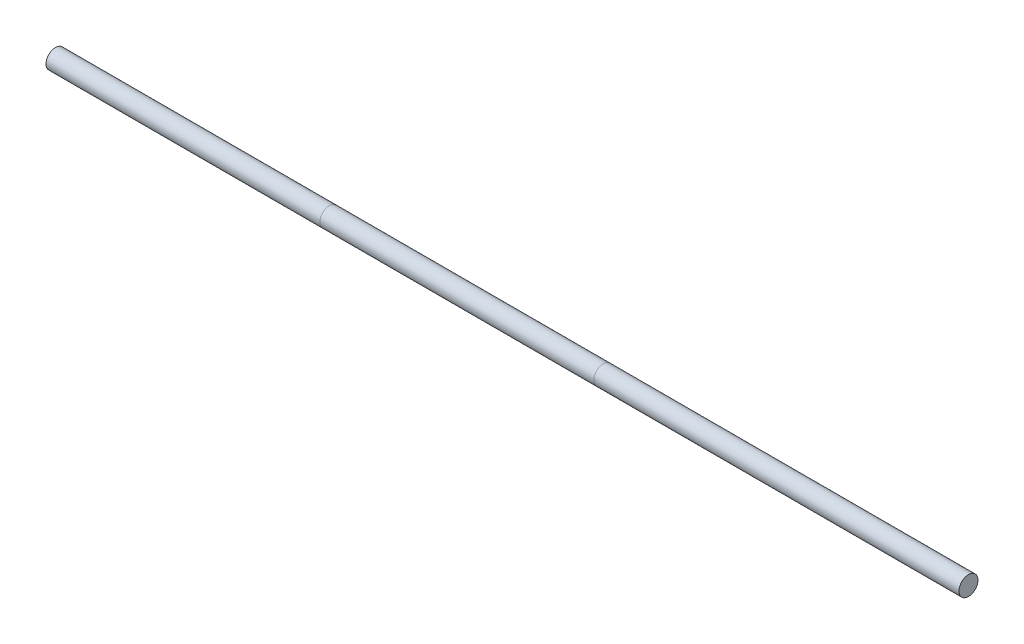
ISO-10303-21;
HEADER;
FILE_DESCRIPTION(('STEP AP214'),'2;1');
FILE_NAME('part.step','',(''),(''),'','','');
FILE_SCHEMA(('AUTOMOTIVE_DESIGN { 1 0 10303 214 1 1 1 1 }'));
ENDSEC;
DATA;
#1=APPLICATION_CONTEXT('core data for automotive mechanical design processes');
#2=APPLICATION_PROTOCOL_DEFINITION('international standard','automotive_design',2000,#1);
#3=PRODUCT_CONTEXT('',#1,'mechanical');
#4=PRODUCT('Part','Part','',(#3));
#5=PRODUCT_RELATED_PRODUCT_CATEGORY('part','',(#4));
#6=PRODUCT_DEFINITION_FORMATION('','',#4);
#7=PRODUCT_DEFINITION_CONTEXT('part definition',#1,'design');
#8=PRODUCT_DEFINITION('design','',#6,#7);
#9=PRODUCT_DEFINITION_SHAPE('','',#8);
#10=(LENGTH_UNIT() NAMED_UNIT(*) SI_UNIT(.MILLI.,.METRE.));
#11=(NAMED_UNIT(*) PLANE_ANGLE_UNIT() SI_UNIT($,.RADIAN.));
#12=(NAMED_UNIT(*) SI_UNIT($,.STERADIAN.) SOLID_ANGLE_UNIT());
#13=UNCERTAINTY_MEASURE_WITH_UNIT(LENGTH_MEASURE(1.E-05),#10,'distance_accuracy_value','');
#14=(GEOMETRIC_REPRESENTATION_CONTEXT(3) GLOBAL_UNCERTAINTY_ASSIGNED_CONTEXT((#13)) GLOBAL_UNIT_ASSIGNED_CONTEXT((#10,
#11,#12)) REPRESENTATION_CONTEXT('',''));
#15=CARTESIAN_POINT('',(0.,0.,0.));
#16=DIRECTION('',(0.,0.,1.));
#17=DIRECTION('',(1.,0.,0.));
#18=AXIS2_PLACEMENT_3D('',#15,#16,#17);
#19=CARTESIAN_POINT('',(3048.,0.,0.));
#20=DIRECTION('',(-1.,0.,0.));
#21=DIRECTION('',(0.,0.,1.));
#22=AXIS2_PLACEMENT_3D('',#19,#20,#21);
#23=CYLINDRICAL_SURFACE('',#22,31.75);
#24=CARTESIAN_POINT('',(3048.,0.,0.));
#25=DIRECTION('',(1.,0.,0.));
#26=DIRECTION('',(0.,0.,-1.));
#27=AXIS2_PLACEMENT_3D('',#24,#25,#26);
#28=CIRCLE('',#27,31.75);
#29=CARTESIAN_POINT('',(3048.,0.,-31.75));
#30=VERTEX_POINT('',#29);
#31=EDGE_CURVE('E11',#30,#30,#28,.T.);
#32=ORIENTED_EDGE('',*,*,#31,.F.);
#33=EDGE_LOOP('',(#32));
#34=FACE_BOUND('',#33,.T.);
#35=CARTESIAN_POINT('',(1828.8,0.,0.));
#36=DIRECTION('',(1.,0.,0.));
#37=DIRECTION('',(0.,0.,-1.));
#38=AXIS2_PLACEMENT_3D('',#35,#36,#37);
#39=CIRCLE('',#38,31.75);
#40=CARTESIAN_POINT('',(1828.8,0.,-31.75));
#41=VERTEX_POINT('',#40);
#42=EDGE_CURVE('E49',#41,#41,#39,.T.);
#43=ORIENTED_EDGE('',*,*,#42,.T.);
#44=EDGE_LOOP('',(#43));
#45=FACE_BOUND('',#44,.T.);
#46=ADVANCED_FACE('F46',(#34,#45),#23,.T.);
#47=CARTESIAN_POINT('',(3048.,0.,0.));
#48=DIRECTION('',(1.,0.,0.));
#49=DIRECTION('',(0.,0.,-1.));
#50=AXIS2_PLACEMENT_3D('',#47,#48,#49);
#51=PLANE('',#50);
#52=ORIENTED_EDGE('',*,*,#31,.T.);
#53=EDGE_LOOP('',(#52));
#54=FACE_BOUND('',#53,.T.);
#55=ADVANCED_FACE('F61',(#54),#51,.T.);
#56=CARTESIAN_POINT('',(1828.8,0.,0.));
#57=DIRECTION('',(1.,0.,0.));
#58=DIRECTION('',(0.,0.,-1.));
#59=AXIS2_PLACEMENT_3D('',#56,#57,#58);
#60=PLANE('',#59);
#61=ORIENTED_EDGE('',*,*,#42,.F.);
#62=EDGE_LOOP('',(#61));
#63=FACE_BOUND('',#62,.T.);
#64=ADVANCED_FACE('F59',(#63),#60,.F.);
#65=CLOSED_SHELL('',(#46,#55,#64));
#66=MANIFOLD_SOLID_BREP('B2',#65);
#67=CARTESIAN_POINT('',(1828.8,0.,0.));
#68=DIRECTION('',(-1.,0.,0.));
#69=DIRECTION('',(0.,0.,1.));
#70=AXIS2_PLACEMENT_3D('',#67,#68,#69);
#71=CYLINDRICAL_SURFACE('',#70,31.75);
#72=CARTESIAN_POINT('',(1828.8,0.,0.));
#73=DIRECTION('',(1.,0.,0.));
#74=DIRECTION('',(0.,0.,-1.));
#75=AXIS2_PLACEMENT_3D('',#72,#73,#74);
#76=CIRCLE('',#75,31.75);
#77=CARTESIAN_POINT('',(1828.8,0.,-31.75));
#78=VERTEX_POINT('',#77);
#79=EDGE_CURVE('E45',#78,#78,#76,.T.);
#80=ORIENTED_EDGE('',*,*,#79,.F.);
#81=EDGE_LOOP('',(#80));
#82=FACE_BOUND('',#81,.T.);
#83=CARTESIAN_POINT('',(914.4,0.,0.));
#84=DIRECTION('',(1.,0.,0.));
#85=DIRECTION('',(0.,0.,-1.));
#86=AXIS2_PLACEMENT_3D('',#83,#84,#85);
#87=CIRCLE('',#86,31.75);
#88=CARTESIAN_POINT('',(914.4,0.,-31.75));
#89=VERTEX_POINT('',#88);
#90=EDGE_CURVE('E97',#89,#89,#87,.T.);
#91=ORIENTED_EDGE('',*,*,#90,.T.);
#92=EDGE_LOOP('',(#91));
#93=FACE_BOUND('',#92,.T.);
#94=ADVANCED_FACE('F94',(#82,#93),#71,.T.);
#95=CARTESIAN_POINT('',(1828.8,0.,0.));
#96=DIRECTION('',(1.,0.,0.));
#97=DIRECTION('',(0.,0.,-1.));
#98=AXIS2_PLACEMENT_3D('',#95,#96,#97);
#99=PLANE('',#98);
#100=ORIENTED_EDGE('',*,*,#79,.T.);
#101=EDGE_LOOP('',(#100));
#102=FACE_BOUND('',#101,.T.);
#103=ADVANCED_FACE('F109',(#102),#99,.T.);
#104=CARTESIAN_POINT('',(914.4,0.,0.));
#105=DIRECTION('',(1.,0.,0.));
#106=DIRECTION('',(0.,0.,-1.));
#107=AXIS2_PLACEMENT_3D('',#104,#105,#106);
#108=PLANE('',#107);
#109=ORIENTED_EDGE('',*,*,#90,.F.);
#110=EDGE_LOOP('',(#109));
#111=FACE_BOUND('',#110,.T.);
#112=ADVANCED_FACE('F107',(#111),#108,.F.);
#113=CLOSED_SHELL('',(#94,#103,#112));
#114=MANIFOLD_SOLID_BREP('B6',#113);
#115=CARTESIAN_POINT('',(914.4,0.,0.));
#116=DIRECTION('',(-1.,0.,0.));
#117=DIRECTION('',(0.,0.,1.));
#118=AXIS2_PLACEMENT_3D('',#115,#116,#117);
#119=CYLINDRICAL_SURFACE('',#118,31.75);
#120=CARTESIAN_POINT('',(914.4,0.,0.));
#121=DIRECTION('',(1.,0.,0.));
#122=DIRECTION('',(0.,0.,-1.));
#123=AXIS2_PLACEMENT_3D('',#120,#121,#122);
#124=CIRCLE('',#123,31.75);
#125=CARTESIAN_POINT('',(914.4,0.,-31.75));
#126=VERTEX_POINT('',#125);
#127=EDGE_CURVE('E93',#126,#126,#124,.T.);
#128=ORIENTED_EDGE('',*,*,#127,.F.);
#129=EDGE_LOOP('',(#128));
#130=FACE_BOUND('',#129,.T.);
#131=CARTESIAN_POINT('',(0.,0.,0.));
#132=DIRECTION('',(1.,0.,0.));
#133=DIRECTION('',(0.,0.,-1.));
#134=AXIS2_PLACEMENT_3D('',#131,#132,#133);
#135=CIRCLE('',#134,31.75);
#136=CARTESIAN_POINT('',(0.,0.,-31.75));
#137=VERTEX_POINT('',#136);
#138=EDGE_CURVE('E138',#137,#137,#135,.T.);
#139=ORIENTED_EDGE('',*,*,#138,.T.);
#140=EDGE_LOOP('',(#139));
#141=FACE_BOUND('',#140,.T.);
#142=ADVANCED_FACE('F135',(#130,#141),#119,.T.);
#143=CARTESIAN_POINT('',(914.4,0.,0.));
#144=DIRECTION('',(1.,0.,0.));
#145=DIRECTION('',(0.,0.,-1.));
#146=AXIS2_PLACEMENT_3D('',#143,#144,#145);
#147=PLANE('',#146);
#148=ORIENTED_EDGE('',*,*,#127,.T.);
#149=EDGE_LOOP('',(#148));
#150=FACE_BOUND('',#149,.T.);
#151=ADVANCED_FACE('F150',(#150),#147,.T.);
#152=CARTESIAN_POINT('',(0.,0.,0.));
#153=DIRECTION('',(1.,0.,0.));
#154=DIRECTION('',(0.,0.,-1.));
#155=AXIS2_PLACEMENT_3D('',#152,#153,#154);
#156=PLANE('',#155);
#157=ORIENTED_EDGE('',*,*,#138,.F.);
#158=EDGE_LOOP('',(#157));
#159=FACE_BOUND('',#158,.T.);
#160=ADVANCED_FACE('F148',(#159),#156,.F.);
#161=CLOSED_SHELL('',(#142,#151,#160));
#162=MANIFOLD_SOLID_BREP('B40',#161);
#163=ADVANCED_BREP_SHAPE_REPRESENTATION('',(#18,#66,#114,#162),#14);
#164=SHAPE_DEFINITION_REPRESENTATION(#9,#163);
ENDSEC;
END-ISO-10303-21;
